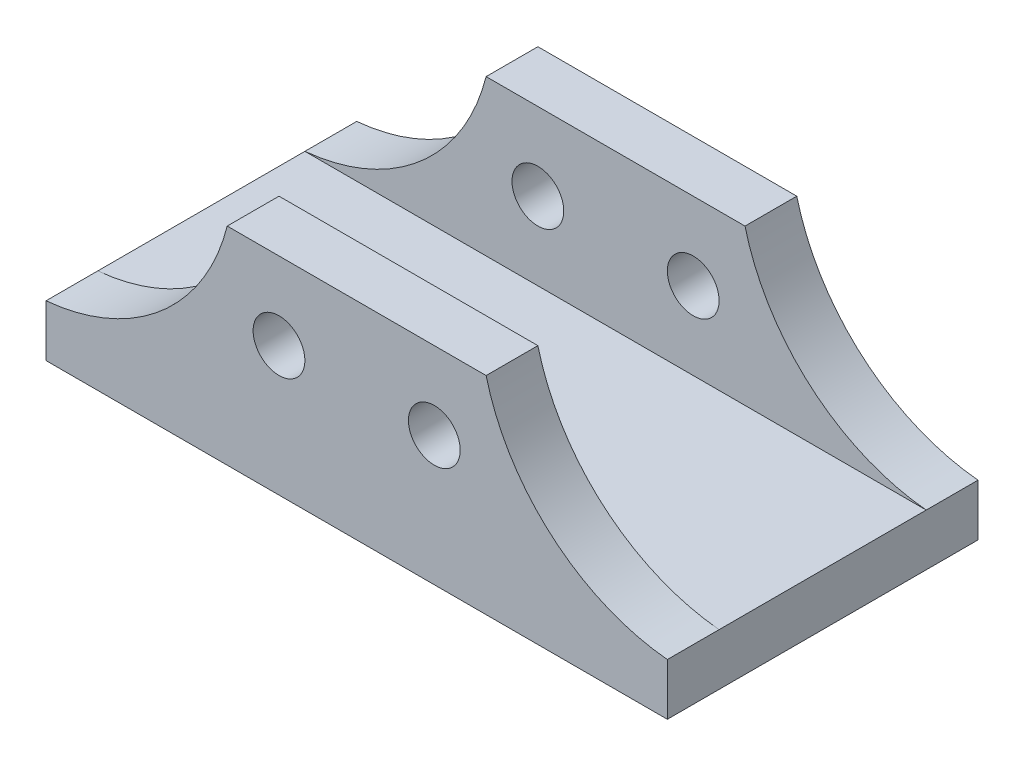
ISO-10303-21;
HEADER;
FILE_DESCRIPTION(('STEP AP214'),'2;1');
FILE_NAME('part.step','',(''),(''),'','','');
FILE_SCHEMA(('AUTOMOTIVE_DESIGN { 1 0 10303 214 1 1 1 1 }'));
ENDSEC;
DATA;
#1=APPLICATION_CONTEXT('core data for automotive mechanical design processes');
#2=APPLICATION_PROTOCOL_DEFINITION('international standard','automotive_design',2000,#1);
#3=PRODUCT_CONTEXT('',#1,'mechanical');
#4=PRODUCT('Part','Part','',(#3));
#5=PRODUCT_RELATED_PRODUCT_CATEGORY('part','',(#4));
#6=PRODUCT_DEFINITION_FORMATION('','',#4);
#7=PRODUCT_DEFINITION_CONTEXT('part definition',#1,'design');
#8=PRODUCT_DEFINITION('design','',#6,#7);
#9=PRODUCT_DEFINITION_SHAPE('','',#8);
#10=(LENGTH_UNIT() NAMED_UNIT(*) SI_UNIT(.MILLI.,.METRE.));
#11=(NAMED_UNIT(*) PLANE_ANGLE_UNIT() SI_UNIT($,.RADIAN.));
#12=(NAMED_UNIT(*) SI_UNIT($,.STERADIAN.) SOLID_ANGLE_UNIT());
#13=UNCERTAINTY_MEASURE_WITH_UNIT(LENGTH_MEASURE(1.E-05),#10,'distance_accuracy_value','');
#14=(GEOMETRIC_REPRESENTATION_CONTEXT(3) GLOBAL_UNCERTAINTY_ASSIGNED_CONTEXT((#13)) GLOBAL_UNIT_ASSIGNED_CONTEXT((#10,
#11,#12)) REPRESENTATION_CONTEXT('',''));
#15=CARTESIAN_POINT('',(0.,0.,0.));
#16=DIRECTION('',(0.,0.,1.));
#17=DIRECTION('',(1.,0.,0.));
#18=AXIS2_PLACEMENT_3D('',#15,#16,#17);
#19=CARTESIAN_POINT('',(-80.9948897328703,50.5732046883487,12.7));
#20=DIRECTION('',(0.,0.,-1.));
#21=DIRECTION('',(-1.,0.,0.));
#22=AXIS2_PLACEMENT_3D('',#19,#20,#21);
#23=PLANE('',#22);
#24=CARTESIAN_POINT('',(-19.05,19.05,12.7));
#25=DIRECTION('',(0.,0.,-1.));
#26=DIRECTION('',(-1.,0.,0.));
#27=AXIS2_PLACEMENT_3D('',#24,#25,#26);
#28=CIRCLE('',#27,6.35);
#29=CARTESIAN_POINT('',(-25.4,19.05,12.7));
#30=VERTEX_POINT('',#29);
#31=EDGE_CURVE('E411',#30,#30,#28,.T.);
#32=ORIENTED_EDGE('',*,*,#31,.T.);
#33=EDGE_LOOP('',(#32));
#34=FACE_BOUND('',#33,.T.);
#35=CARTESIAN_POINT('',(19.05,19.05,12.7));
#36=DIRECTION('',(0.,0.,-1.));
#37=DIRECTION('',(-1.,0.,0.));
#38=AXIS2_PLACEMENT_3D('',#35,#36,#37);
#39=CIRCLE('',#38,6.35);
#40=CARTESIAN_POINT('',(12.7,19.05,12.7));
#41=VERTEX_POINT('',#40);
#42=EDGE_CURVE('E156',#41,#41,#39,.T.);
#43=ORIENTED_EDGE('',*,*,#42,.T.);
#44=EDGE_LOOP('',(#43));
#45=FACE_BOUND('',#44,.T.);
#46=DIRECTION('',(-1.,0.,0.));
#47=VECTOR('',#46,1.);
#48=CARTESIAN_POINT('',(-76.2,0.,12.7));
#49=LINE('',#48,#47);
#50=CARTESIAN_POINT('',(76.2,0.,12.7));
#51=VERTEX_POINT('',#50);
#52=CARTESIAN_POINT('',(-76.2,0.,12.7));
#53=VERTEX_POINT('',#52);
#54=EDGE_CURVE('E84',#51,#53,#49,.T.);
#55=ORIENTED_EDGE('',*,*,#54,.F.);
#56=CARTESIAN_POINT('',(80.9948897328703,50.5732046883487,12.7));
#57=DIRECTION('',(0.,0.,-1.));
#58=DIRECTION('',(1.,0.,0.));
#59=AXIS2_PLACEMENT_3D('',#56,#57,#58);
#60=CIRCLE('',#59,50.8);
#61=CARTESIAN_POINT('',(31.75,38.1,12.7));
#62=VERTEX_POINT('',#61);
#63=EDGE_CURVE('E189',#51,#62,#60,.T.);
#64=ORIENTED_EDGE('',*,*,#63,.T.);
#65=DIRECTION('',(-1.,0.,0.));
#66=VECTOR('',#65,1.);
#67=CARTESIAN_POINT('',(-31.75,38.1,12.7));
#68=LINE('',#67,#66);
#69=CARTESIAN_POINT('',(-31.75,38.1,12.7));
#70=VERTEX_POINT('',#69);
#71=EDGE_CURVE('E51',#62,#70,#68,.T.);
#72=ORIENTED_EDGE('',*,*,#71,.T.);
#73=CARTESIAN_POINT('',(-80.9948897328703,50.5732046883487,12.7));
#74=DIRECTION('',(0.,0.,-1.));
#75=DIRECTION('',(-1.,0.,0.));
#76=AXIS2_PLACEMENT_3D('',#73,#74,#75);
#77=CIRCLE('',#76,50.8);
#78=EDGE_CURVE('E187',#70,#53,#77,.T.);
#79=ORIENTED_EDGE('',*,*,#78,.T.);
#80=EDGE_LOOP('',(#55,#64,#72,#79));
#81=FACE_BOUND('',#80,.T.);
#82=ADVANCED_FACE('F34',(#34,#45,#81),#23,.F.);
#83=CARTESIAN_POINT('',(-80.9948897328703,50.5732046883487,12.7));
#84=DIRECTION('',(0.,0.,-1.));
#85=DIRECTION('',(-1.,0.,0.));
#86=AXIS2_PLACEMENT_3D('',#83,#84,#85);
#87=CYLINDRICAL_SURFACE('',#86,50.8);
#88=CARTESIAN_POINT('',(-80.9948897328703,50.5732046883487,0.));
#89=DIRECTION('',(0.,0.,-1.));
#90=DIRECTION('',(-1.,0.,0.));
#91=AXIS2_PLACEMENT_3D('',#88,#89,#90);
#92=CIRCLE('',#91,50.8);
#93=CARTESIAN_POINT('',(-31.75,38.1,0.));
#94=VERTEX_POINT('',#93);
#95=CARTESIAN_POINT('',(-76.2,0.,0.));
#96=VERTEX_POINT('',#95);
#97=EDGE_CURVE('E186',#94,#96,#92,.T.);
#98=ORIENTED_EDGE('',*,*,#97,.T.);
#99=DIRECTION('',(0.,0.,-1.));
#100=VECTOR('',#99,1.);
#101=CARTESIAN_POINT('',(-76.2,0.,12.7));
#102=LINE('',#101,#100);
#103=EDGE_CURVE('E11',#53,#96,#102,.T.);
#104=ORIENTED_EDGE('',*,*,#103,.F.);
#105=ORIENTED_EDGE('',*,*,#78,.F.);
#106=DIRECTION('',(0.,0.,-1.));
#107=VECTOR('',#106,1.);
#108=CARTESIAN_POINT('',(-31.75,38.1,12.7));
#109=LINE('',#108,#107);
#110=EDGE_CURVE('E192',#70,#94,#109,.T.);
#111=ORIENTED_EDGE('',*,*,#110,.T.);
#112=EDGE_LOOP('',(#98,#104,#105,#111));
#113=FACE_BOUND('',#112,.T.);
#114=ADVANCED_FACE('F36',(#113),#87,.F.);
#115=CARTESIAN_POINT('',(-76.2,0.,12.7));
#116=DIRECTION('',(1.,0.,0.));
#117=DIRECTION('',(0.,0.,-1.));
#118=AXIS2_PLACEMENT_3D('',#115,#116,#117);
#119=PLANE('',#118);
#120=DIRECTION('',(0.,-1.,0.));
#121=VECTOR('',#120,1.);
#122=CARTESIAN_POINT('',(-76.2,0.,0.));
#123=LINE('',#122,#121);
#124=CARTESIAN_POINT('',(-76.2,-12.7,0.));
#125=VERTEX_POINT('',#124);
#126=EDGE_CURVE('E195',#96,#125,#123,.T.);
#127=ORIENTED_EDGE('',*,*,#126,.T.);
#128=DIRECTION('',(0.,0.,-1.));
#129=VECTOR('',#128,1.);
#130=CARTESIAN_POINT('',(-76.2,-12.7,12.7));
#131=LINE('',#130,#129);
#132=CARTESIAN_POINT('',(-76.2,-12.7,76.2));
#133=VERTEX_POINT('',#132);
#134=EDGE_CURVE('E43',#133,#125,#131,.T.);
#135=ORIENTED_EDGE('',*,*,#134,.F.);
#136=DIRECTION('',(0.,-1.,0.));
#137=VECTOR('',#136,1.);
#138=CARTESIAN_POINT('',(-76.2,0.,76.2));
#139=LINE('',#138,#137);
#140=CARTESIAN_POINT('',(-76.2,0.,76.2));
#141=VERTEX_POINT('',#140);
#142=EDGE_CURVE('E135',#141,#133,#139,.T.);
#143=ORIENTED_EDGE('',*,*,#142,.F.);
#144=DIRECTION('',(0.,0.,1.));
#145=VECTOR('',#144,1.);
#146=CARTESIAN_POINT('',(-76.2,0.,63.5));
#147=LINE('',#146,#145);
#148=CARTESIAN_POINT('',(-76.2,0.,63.5));
#149=VERTEX_POINT('',#148);
#150=EDGE_CURVE('E131',#149,#141,#147,.T.);
#151=ORIENTED_EDGE('',*,*,#150,.F.);
#152=DIRECTION('',(0.,0.,-1.));
#153=VECTOR('',#152,1.);
#154=CARTESIAN_POINT('',(-76.2,0.,38.1));
#155=LINE('',#154,#153);
#156=EDGE_CURVE('E121',#149,#53,#155,.T.);
#157=ORIENTED_EDGE('',*,*,#156,.T.);
#158=ORIENTED_EDGE('',*,*,#103,.T.);
#159=EDGE_LOOP('',(#127,#135,#143,#151,#157,#158));
#160=FACE_BOUND('',#159,.T.);
#161=ADVANCED_FACE('F133',(#160),#119,.F.);
#162=CARTESIAN_POINT('',(-76.2,-12.7,12.7));
#163=DIRECTION('',(0.,1.,0.));
#164=DIRECTION('',(-1.,0.,0.));
#165=AXIS2_PLACEMENT_3D('',#162,#163,#164);
#166=PLANE('',#165);
#167=DIRECTION('',(1.,0.,0.));
#168=VECTOR('',#167,1.);
#169=CARTESIAN_POINT('',(-76.2,-12.7,0.));
#170=LINE('',#169,#168);
#171=CARTESIAN_POINT('',(76.2,-12.7,0.));
#172=VERTEX_POINT('',#171);
#173=EDGE_CURVE('E197',#125,#172,#170,.T.);
#174=ORIENTED_EDGE('',*,*,#173,.T.);
#175=DIRECTION('',(0.,0.,-1.));
#176=VECTOR('',#175,1.);
#177=CARTESIAN_POINT('',(76.2,-12.7,12.7));
#178=LINE('',#177,#176);
#179=CARTESIAN_POINT('',(76.2,-12.7,76.2));
#180=VERTEX_POINT('',#179);
#181=EDGE_CURVE('E208',#180,#172,#178,.T.);
#182=ORIENTED_EDGE('',*,*,#181,.F.);
#183=DIRECTION('',(1.,0.,0.));
#184=VECTOR('',#183,1.);
#185=CARTESIAN_POINT('',(-76.2,-12.7,76.2));
#186=LINE('',#185,#184);
#187=EDGE_CURVE('E168',#133,#180,#186,.T.);
#188=ORIENTED_EDGE('',*,*,#187,.F.);
#189=ORIENTED_EDGE('',*,*,#134,.T.);
#190=EDGE_LOOP('',(#174,#182,#188,#189));
#191=FACE_BOUND('',#190,.T.);
#192=ADVANCED_FACE('F214',(#191),#166,.F.);
#193=CARTESIAN_POINT('',(76.2,0.,12.7));
#194=DIRECTION('',(-1.,0.,0.));
#195=DIRECTION('',(0.,0.,1.));
#196=AXIS2_PLACEMENT_3D('',#193,#194,#195);
#197=PLANE('',#196);
#198=DIRECTION('',(0.,1.,0.));
#199=VECTOR('',#198,1.);
#200=CARTESIAN_POINT('',(76.2,0.,0.));
#201=LINE('',#200,#199);
#202=CARTESIAN_POINT('',(76.2,0.,0.));
#203=VERTEX_POINT('',#202);
#204=EDGE_CURVE('E199',#172,#203,#201,.T.);
#205=ORIENTED_EDGE('',*,*,#204,.T.);
#206=DIRECTION('',(0.,0.,-1.));
#207=VECTOR('',#206,1.);
#208=CARTESIAN_POINT('',(76.2,0.,12.7));
#209=LINE('',#208,#207);
#210=EDGE_CURVE('E206',#51,#203,#209,.T.);
#211=ORIENTED_EDGE('',*,*,#210,.F.);
#212=DIRECTION('',(0.,0.,-1.));
#213=VECTOR('',#212,1.);
#214=CARTESIAN_POINT('',(76.2,0.,38.1));
#215=LINE('',#214,#213);
#216=CARTESIAN_POINT('',(76.2,0.,63.5));
#217=VERTEX_POINT('',#216);
#218=EDGE_CURVE('E128',#217,#51,#215,.T.);
#219=ORIENTED_EDGE('',*,*,#218,.F.);
#220=DIRECTION('',(0.,0.,1.));
#221=VECTOR('',#220,1.);
#222=CARTESIAN_POINT('',(76.2,0.,63.5));
#223=LINE('',#222,#221);
#224=CARTESIAN_POINT('',(76.2,0.,76.2));
#225=VERTEX_POINT('',#224);
#226=EDGE_CURVE('E139',#217,#225,#223,.T.);
#227=ORIENTED_EDGE('',*,*,#226,.T.);
#228=DIRECTION('',(0.,1.,0.));
#229=VECTOR('',#228,1.);
#230=CARTESIAN_POINT('',(76.2,0.,76.2));
#231=LINE('',#230,#229);
#232=EDGE_CURVE('E171',#180,#225,#231,.T.);
#233=ORIENTED_EDGE('',*,*,#232,.F.);
#234=ORIENTED_EDGE('',*,*,#181,.T.);
#235=EDGE_LOOP('',(#205,#211,#219,#227,#233,#234));
#236=FACE_BOUND('',#235,.T.);
#237=ADVANCED_FACE('F220',(#236),#197,.F.);
#238=CARTESIAN_POINT('',(80.9948897328703,50.5732046883487,12.7));
#239=DIRECTION('',(0.,0.,-1.));
#240=DIRECTION('',(-1.,0.,0.));
#241=AXIS2_PLACEMENT_3D('',#238,#239,#240);
#242=CYLINDRICAL_SURFACE('',#241,50.8);
#243=CARTESIAN_POINT('',(80.9948897328703,50.5732046883487,0.));
#244=DIRECTION('',(0.,0.,-1.));
#245=DIRECTION('',(1.,0.,0.));
#246=AXIS2_PLACEMENT_3D('',#243,#244,#245);
#247=CIRCLE('',#246,50.8);
#248=CARTESIAN_POINT('',(31.75,38.1,0.));
#249=VERTEX_POINT('',#248);
#250=EDGE_CURVE('E75',#203,#249,#247,.T.);
#251=ORIENTED_EDGE('',*,*,#250,.T.);
#252=DIRECTION('',(0.,0.,-1.));
#253=VECTOR('',#252,1.);
#254=CARTESIAN_POINT('',(31.75,38.1,12.7));
#255=LINE('',#254,#253);
#256=EDGE_CURVE('E204',#62,#249,#255,.T.);
#257=ORIENTED_EDGE('',*,*,#256,.F.);
#258=ORIENTED_EDGE('',*,*,#63,.F.);
#259=ORIENTED_EDGE('',*,*,#210,.T.);
#260=EDGE_LOOP('',(#251,#257,#258,#259));
#261=FACE_BOUND('',#260,.T.);
#262=ADVANCED_FACE('F223',(#261),#242,.F.);
#263=CARTESIAN_POINT('',(-31.75,38.1,12.7));
#264=DIRECTION('',(0.,-1.,0.));
#265=DIRECTION('',(0.,0.,-1.));
#266=AXIS2_PLACEMENT_3D('',#263,#264,#265);
#267=PLANE('',#266);
#268=DIRECTION('',(-1.,0.,0.));
#269=VECTOR('',#268,1.);
#270=CARTESIAN_POINT('',(-31.75,38.1,0.));
#271=LINE('',#270,#269);
#272=EDGE_CURVE('E80',#249,#94,#271,.T.);
#273=ORIENTED_EDGE('',*,*,#272,.T.);
#274=ORIENTED_EDGE('',*,*,#110,.F.);
#275=ORIENTED_EDGE('',*,*,#71,.F.);
#276=ORIENTED_EDGE('',*,*,#256,.T.);
#277=EDGE_LOOP('',(#273,#274,#275,#276));
#278=FACE_BOUND('',#277,.T.);
#279=ADVANCED_FACE('F255',(#278),#267,.F.);
#280=CARTESIAN_POINT('',(-80.9948897328703,50.5732046883487,0.));
#281=DIRECTION('',(0.,0.,-1.));
#282=DIRECTION('',(-1.,0.,0.));
#283=AXIS2_PLACEMENT_3D('',#280,#281,#282);
#284=PLANE('',#283);
#285=CARTESIAN_POINT('',(-19.05,19.05,0.));
#286=DIRECTION('',(0.,0.,-1.));
#287=DIRECTION('',(-1.,0.,0.));
#288=AXIS2_PLACEMENT_3D('',#285,#286,#287);
#289=CIRCLE('',#288,6.35);
#290=CARTESIAN_POINT('',(-25.4,19.05,0.));
#291=VERTEX_POINT('',#290);
#292=EDGE_CURVE('E409',#291,#291,#289,.T.);
#293=ORIENTED_EDGE('',*,*,#292,.F.);
#294=EDGE_LOOP('',(#293));
#295=FACE_BOUND('',#294,.T.);
#296=CARTESIAN_POINT('',(19.05,19.05,0.));
#297=DIRECTION('',(0.,0.,-1.));
#298=DIRECTION('',(-1.,0.,0.));
#299=AXIS2_PLACEMENT_3D('',#296,#297,#298);
#300=CIRCLE('',#299,6.35);
#301=CARTESIAN_POINT('',(12.7,19.05,0.));
#302=VERTEX_POINT('',#301);
#303=EDGE_CURVE('E412',#302,#302,#300,.T.);
#304=ORIENTED_EDGE('',*,*,#303,.F.);
#305=EDGE_LOOP('',(#304));
#306=FACE_BOUND('',#305,.T.);
#307=ORIENTED_EDGE('',*,*,#97,.F.);
#308=ORIENTED_EDGE('',*,*,#272,.F.);
#309=ORIENTED_EDGE('',*,*,#250,.F.);
#310=ORIENTED_EDGE('',*,*,#204,.F.);
#311=ORIENTED_EDGE('',*,*,#173,.F.);
#312=ORIENTED_EDGE('',*,*,#126,.F.);
#313=EDGE_LOOP('',(#307,#308,#309,#310,#311,#312));
#314=FACE_BOUND('',#313,.T.);
#315=ADVANCED_FACE('F218',(#295,#306,#314),#284,.T.);
#316=CARTESIAN_POINT('',(-76.2,0.,38.1));
#317=DIRECTION('',(0.,-1.,0.));
#318=DIRECTION('',(0.,0.,-1.));
#319=AXIS2_PLACEMENT_3D('',#316,#317,#318);
#320=PLANE('',#319);
#321=ORIENTED_EDGE('',*,*,#54,.T.);
#322=ORIENTED_EDGE('',*,*,#156,.F.);
#323=DIRECTION('',(-1.,0.,0.));
#324=VECTOR('',#323,1.);
#325=CARTESIAN_POINT('',(-76.2,0.,63.5));
#326=LINE('',#325,#324);
#327=EDGE_CURVE('E126',#217,#149,#326,.T.);
#328=ORIENTED_EDGE('',*,*,#327,.F.);
#329=ORIENTED_EDGE('',*,*,#218,.T.);
#330=EDGE_LOOP('',(#321,#322,#328,#329));
#331=FACE_BOUND('',#330,.T.);
#332=ADVANCED_FACE('F123',(#331),#320,.F.);
#333=CARTESIAN_POINT('',(-80.9948897328703,50.5732046883487,63.5));
#334=DIRECTION('',(0.,0.,1.));
#335=DIRECTION('',(-1.,0.,0.));
#336=AXIS2_PLACEMENT_3D('',#333,#334,#335);
#337=PLANE('',#336);
#338=CARTESIAN_POINT('',(-19.05,19.05,63.5));
#339=DIRECTION('',(0.,0.,1.));
#340=DIRECTION('',(1.,0.,0.));
#341=AXIS2_PLACEMENT_3D('',#338,#339,#340);
#342=CIRCLE('',#341,6.35);
#343=CARTESIAN_POINT('',(-12.7,19.05,63.5));
#344=VERTEX_POINT('',#343);
#345=EDGE_CURVE('E413',#344,#344,#342,.T.);
#346=ORIENTED_EDGE('',*,*,#345,.T.);
#347=EDGE_LOOP('',(#346));
#348=FACE_BOUND('',#347,.T.);
#349=CARTESIAN_POINT('',(19.05,19.05,63.5));
#350=DIRECTION('',(0.,0.,1.));
#351=DIRECTION('',(1.,0.,0.));
#352=AXIS2_PLACEMENT_3D('',#349,#350,#351);
#353=CIRCLE('',#352,6.35);
#354=CARTESIAN_POINT('',(25.4,19.05,63.5));
#355=VERTEX_POINT('',#354);
#356=EDGE_CURVE('E160',#355,#355,#353,.T.);
#357=ORIENTED_EDGE('',*,*,#356,.T.);
#358=EDGE_LOOP('',(#357));
#359=FACE_BOUND('',#358,.T.);
#360=ORIENTED_EDGE('',*,*,#327,.T.);
#361=CARTESIAN_POINT('',(-80.9948897328703,50.5732046883487,63.5));
#362=DIRECTION('',(0.,0.,-1.));
#363=DIRECTION('',(-1.,0.,0.));
#364=AXIS2_PLACEMENT_3D('',#361,#362,#363);
#365=CIRCLE('',#364,50.8);
#366=CARTESIAN_POINT('',(-31.75,38.1,63.5));
#367=VERTEX_POINT('',#366);
#368=EDGE_CURVE('E142',#367,#149,#365,.T.);
#369=ORIENTED_EDGE('',*,*,#368,.F.);
#370=DIRECTION('',(-1.,0.,0.));
#371=VECTOR('',#370,1.);
#372=CARTESIAN_POINT('',(-31.75,38.1,63.5));
#373=LINE('',#372,#371);
#374=CARTESIAN_POINT('',(31.75,38.1,63.5));
#375=VERTEX_POINT('',#374);
#376=EDGE_CURVE('E165',#375,#367,#373,.T.);
#377=ORIENTED_EDGE('',*,*,#376,.F.);
#378=CARTESIAN_POINT('',(80.9948897328703,50.5732046883487,63.5));
#379=DIRECTION('',(0.,0.,-1.));
#380=DIRECTION('',(1.,0.,0.));
#381=AXIS2_PLACEMENT_3D('',#378,#379,#380);
#382=CIRCLE('',#381,50.8);
#383=EDGE_CURVE('E149',#217,#375,#382,.T.);
#384=ORIENTED_EDGE('',*,*,#383,.F.);
#385=EDGE_LOOP('',(#360,#369,#377,#384));
#386=FACE_BOUND('',#385,.T.);
#387=ADVANCED_FACE('F153',(#348,#359,#386),#337,.F.);
#388=CARTESIAN_POINT('',(-80.9948897328703,50.5732046883487,63.5));
#389=DIRECTION('',(0.,0.,1.));
#390=DIRECTION('',(-1.,0.,0.));
#391=AXIS2_PLACEMENT_3D('',#388,#389,#390);
#392=CYLINDRICAL_SURFACE('',#391,50.8);
#393=CARTESIAN_POINT('',(-80.9948897328703,50.5732046883487,76.2));
#394=DIRECTION('',(0.,0.,-1.));
#395=DIRECTION('',(-1.,0.,0.));
#396=AXIS2_PLACEMENT_3D('',#393,#394,#395);
#397=CIRCLE('',#396,50.8);
#398=CARTESIAN_POINT('',(-31.75,38.1,76.2));
#399=VERTEX_POINT('',#398);
#400=EDGE_CURVE('E155',#399,#141,#397,.T.);
#401=ORIENTED_EDGE('',*,*,#400,.F.);
#402=DIRECTION('',(0.,0.,1.));
#403=VECTOR('',#402,1.);
#404=CARTESIAN_POINT('',(-31.75,38.1,63.5));
#405=LINE('',#404,#403);
#406=EDGE_CURVE('E145',#367,#399,#405,.T.);
#407=ORIENTED_EDGE('',*,*,#406,.F.);
#408=ORIENTED_EDGE('',*,*,#368,.T.);
#409=ORIENTED_EDGE('',*,*,#150,.T.);
#410=EDGE_LOOP('',(#401,#407,#408,#409));
#411=FACE_BOUND('',#410,.T.);
#412=ADVANCED_FACE('F143',(#411),#392,.F.);
#413=CARTESIAN_POINT('',(80.9948897328703,50.5732046883487,63.5));
#414=DIRECTION('',(0.,0.,1.));
#415=DIRECTION('',(-1.,0.,0.));
#416=AXIS2_PLACEMENT_3D('',#413,#414,#415);
#417=CYLINDRICAL_SURFACE('',#416,50.8);
#418=CARTESIAN_POINT('',(80.9948897328703,50.5732046883487,76.2));
#419=DIRECTION('',(0.,0.,-1.));
#420=DIRECTION('',(1.,0.,0.));
#421=AXIS2_PLACEMENT_3D('',#418,#419,#420);
#422=CIRCLE('',#421,50.8);
#423=CARTESIAN_POINT('',(31.75,38.1,76.2));
#424=VERTEX_POINT('',#423);
#425=EDGE_CURVE('E174',#225,#424,#422,.T.);
#426=ORIENTED_EDGE('',*,*,#425,.F.);
#427=ORIENTED_EDGE('',*,*,#226,.F.);
#428=ORIENTED_EDGE('',*,*,#383,.T.);
#429=DIRECTION('',(0.,0.,1.));
#430=VECTOR('',#429,1.);
#431=CARTESIAN_POINT('',(31.75,38.1,63.5));
#432=LINE('',#431,#430);
#433=EDGE_CURVE('E179',#375,#424,#432,.T.);
#434=ORIENTED_EDGE('',*,*,#433,.T.);
#435=EDGE_LOOP('',(#426,#427,#428,#434));
#436=FACE_BOUND('',#435,.T.);
#437=ADVANCED_FACE('F226',(#436),#417,.F.);
#438=CARTESIAN_POINT('',(-31.75,38.1,63.5));
#439=DIRECTION('',(0.,-1.,0.));
#440=DIRECTION('',(0.,0.,1.));
#441=AXIS2_PLACEMENT_3D('',#438,#439,#440);
#442=PLANE('',#441);
#443=DIRECTION('',(-1.,0.,0.));
#444=VECTOR('',#443,1.);
#445=CARTESIAN_POINT('',(-31.75,38.1,76.2));
#446=LINE('',#445,#444);
#447=EDGE_CURVE('E150',#424,#399,#446,.T.);
#448=ORIENTED_EDGE('',*,*,#447,.F.);
#449=ORIENTED_EDGE('',*,*,#433,.F.);
#450=ORIENTED_EDGE('',*,*,#376,.T.);
#451=ORIENTED_EDGE('',*,*,#406,.T.);
#452=EDGE_LOOP('',(#448,#449,#450,#451));
#453=FACE_BOUND('',#452,.T.);
#454=ADVANCED_FACE('F230',(#453),#442,.F.);
#455=CARTESIAN_POINT('',(-80.9948897328703,50.5732046883487,76.2));
#456=DIRECTION('',(0.,0.,1.));
#457=DIRECTION('',(-1.,0.,0.));
#458=AXIS2_PLACEMENT_3D('',#455,#456,#457);
#459=PLANE('',#458);
#460=CARTESIAN_POINT('',(-19.05,19.05,76.2));
#461=DIRECTION('',(0.,0.,-1.));
#462=DIRECTION('',(-1.,0.,0.));
#463=AXIS2_PLACEMENT_3D('',#460,#461,#462);
#464=CIRCLE('',#463,6.35);
#465=CARTESIAN_POINT('',(-25.4,19.05,76.2));
#466=VERTEX_POINT('',#465);
#467=EDGE_CURVE('E419',#466,#466,#464,.T.);
#468=ORIENTED_EDGE('',*,*,#467,.T.);
#469=EDGE_LOOP('',(#468));
#470=FACE_BOUND('',#469,.T.);
#471=CARTESIAN_POINT('',(19.05,19.05,76.2));
#472=DIRECTION('',(0.,0.,-1.));
#473=DIRECTION('',(-1.,0.,0.));
#474=AXIS2_PLACEMENT_3D('',#471,#472,#473);
#475=CIRCLE('',#474,6.35);
#476=CARTESIAN_POINT('',(12.7,19.05,76.2));
#477=VERTEX_POINT('',#476);
#478=EDGE_CURVE('E416',#477,#477,#475,.T.);
#479=ORIENTED_EDGE('',*,*,#478,.T.);
#480=EDGE_LOOP('',(#479));
#481=FACE_BOUND('',#480,.T.);
#482=ORIENTED_EDGE('',*,*,#400,.T.);
#483=ORIENTED_EDGE('',*,*,#142,.T.);
#484=ORIENTED_EDGE('',*,*,#187,.T.);
#485=ORIENTED_EDGE('',*,*,#232,.T.);
#486=ORIENTED_EDGE('',*,*,#425,.T.);
#487=ORIENTED_EDGE('',*,*,#447,.T.);
#488=EDGE_LOOP('',(#482,#483,#484,#485,#486,#487));
#489=FACE_BOUND('',#488,.T.);
#490=ADVANCED_FACE('F228',(#470,#481,#489),#459,.T.);
#491=CARTESIAN_POINT('',(19.05,19.05,76.2));
#492=DIRECTION('',(0.,0.,-1.));
#493=DIRECTION('',(-1.,0.,0.));
#494=AXIS2_PLACEMENT_3D('',#491,#492,#493);
#495=CYLINDRICAL_SURFACE('',#494,6.35);
#496=ORIENTED_EDGE('',*,*,#478,.F.);
#497=EDGE_LOOP('',(#496));
#498=FACE_BOUND('',#497,.T.);
#499=ORIENTED_EDGE('',*,*,#356,.F.);
#500=EDGE_LOOP('',(#499));
#501=FACE_BOUND('',#500,.T.);
#502=ADVANCED_FACE('F237',(#498,#501),#495,.F.);
#503=ORIENTED_EDGE('',*,*,#303,.T.);
#504=EDGE_LOOP('',(#503));
#505=FACE_BOUND('',#504,.T.);
#506=ORIENTED_EDGE('',*,*,#42,.F.);
#507=EDGE_LOOP('',(#506));
#508=FACE_BOUND('',#507,.T.);
#509=ADVANCED_FACE('F328',(#505,#508),#495,.F.);
#510=CARTESIAN_POINT('',(-19.05,19.05,76.2));
#511=DIRECTION('',(0.,0.,-1.));
#512=DIRECTION('',(-1.,0.,0.));
#513=AXIS2_PLACEMENT_3D('',#510,#511,#512);
#514=CYLINDRICAL_SURFACE('',#513,6.35);
#515=ORIENTED_EDGE('',*,*,#467,.F.);
#516=EDGE_LOOP('',(#515));
#517=FACE_BOUND('',#516,.T.);
#518=ORIENTED_EDGE('',*,*,#345,.F.);
#519=EDGE_LOOP('',(#518));
#520=FACE_BOUND('',#519,.T.);
#521=ADVANCED_FACE('F336',(#517,#520),#514,.F.);
#522=ORIENTED_EDGE('',*,*,#292,.T.);
#523=EDGE_LOOP('',(#522));
#524=FACE_BOUND('',#523,.T.);
#525=ORIENTED_EDGE('',*,*,#31,.F.);
#526=EDGE_LOOP('',(#525));
#527=FACE_BOUND('',#526,.T.);
#528=ADVANCED_FACE('F343',(#524,#527),#514,.F.);
#529=CLOSED_SHELL('',(#82,#114,#161,#192,#237,#262,#279,#315,#332,#387,#412,#437,#454,#490,#502,
#509,#521,#528));
#530=MANIFOLD_SOLID_BREP('B2',#529);
#531=ADVANCED_BREP_SHAPE_REPRESENTATION('',(#18,#530),#14);
#532=SHAPE_DEFINITION_REPRESENTATION(#9,#531);
ENDSEC;
END-ISO-10303-21;
